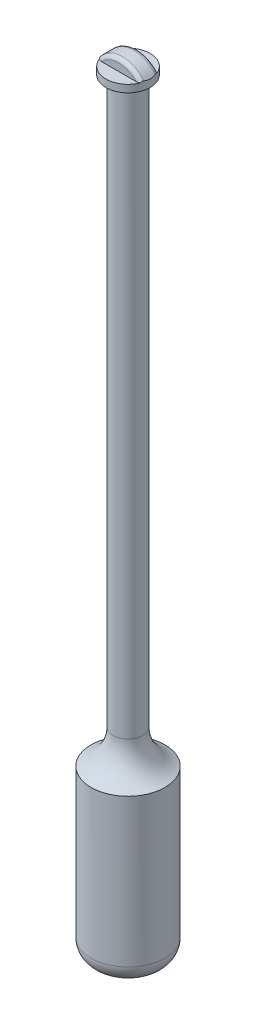
ISO-10303-21;
HEADER;
FILE_DESCRIPTION(('STEP AP214'),'2;1');
FILE_NAME('part.step','',(''),(''),'','','');
FILE_SCHEMA(('AUTOMOTIVE_DESIGN { 1 0 10303 214 1 1 1 1 }'));
ENDSEC;
DATA;
#1=APPLICATION_CONTEXT('core data for automotive mechanical design processes');
#2=APPLICATION_PROTOCOL_DEFINITION('international standard','automotive_design',2000,#1);
#3=PRODUCT_CONTEXT('',#1,'mechanical');
#4=PRODUCT('Part','Part','',(#3));
#5=PRODUCT_RELATED_PRODUCT_CATEGORY('part','',(#4));
#6=PRODUCT_DEFINITION_FORMATION('','',#4);
#7=PRODUCT_DEFINITION_CONTEXT('part definition',#1,'design');
#8=PRODUCT_DEFINITION('design','',#6,#7);
#9=PRODUCT_DEFINITION_SHAPE('','',#8);
#10=(LENGTH_UNIT() NAMED_UNIT(*) SI_UNIT(.MILLI.,.METRE.));
#11=(NAMED_UNIT(*) PLANE_ANGLE_UNIT() SI_UNIT($,.RADIAN.));
#12=(NAMED_UNIT(*) SI_UNIT($,.STERADIAN.) SOLID_ANGLE_UNIT());
#13=UNCERTAINTY_MEASURE_WITH_UNIT(LENGTH_MEASURE(1.E-05),#10,'distance_accuracy_value','');
#14=(GEOMETRIC_REPRESENTATION_CONTEXT(3) GLOBAL_UNCERTAINTY_ASSIGNED_CONTEXT((#13)) GLOBAL_UNIT_ASSIGNED_CONTEXT((#10,
#11,#12)) REPRESENTATION_CONTEXT('',''));
#15=CARTESIAN_POINT('',(0.,0.,0.));
#16=DIRECTION('',(0.,0.,1.));
#17=DIRECTION('',(1.,0.,0.));
#18=AXIS2_PLACEMENT_3D('',#15,#16,#17);
#19=CARTESIAN_POINT('',(0.,204.5,2.5));
#20=DIRECTION('',(0.,0.,-1.));
#21=DIRECTION('',(-1.,0.,0.));
#22=AXIS2_PLACEMENT_3D('',#19,#20,#21);
#23=CYLINDRICAL_SURFACE('',#22,7.5);
#24=CARTESIAN_POINT('',(5.45435605731786,209.647815070494,-2.5));
#25=CARTESIAN_POINT('',(5.50100393738986,209.598398753285,-2.39818061808659));
#26=CARTESIAN_POINT('',(5.54506690321261,209.550355885145,-2.29455820553938));
#27=CARTESIAN_POINT('',(5.62782344744621,209.457966710313,-2.08340038923625));
#28=CARTESIAN_POINT('',(5.66650935310739,209.413625721269,-1.97585966474265));
#29=CARTESIAN_POINT('',(5.77486243246658,209.286796746726,-1.64474429999279));
#30=CARTESIAN_POINT('',(5.83570460789083,209.211724438596,-1.41508251851409));
#31=CARTESIAN_POINT('',(5.90694830936014,209.121629774424,-1.0596306430481));
#32=CARTESIAN_POINT('',(5.92741576688814,209.095269025482,-0.938625335254704));
#33=CARTESIAN_POINT('',(5.96101368246352,209.051601763958,-0.693932543819982));
#34=CARTESIAN_POINT('',(5.97414420439908,209.034295172536,-0.570245083543895));
#35=CARTESIAN_POINT('',(5.99262466639059,209.009843411924,-0.32219179295885));
#36=CARTESIAN_POINT('',(5.99803021915583,209.002625620944,-0.197837347550159));
#37=CARTESIAN_POINT('',(6.0010729275826,208.998570059253,0.0511278524662602));
#38=CARTESIAN_POINT('',(5.99871124598981,209.001730734897,0.175738565920058));
#39=CARTESIAN_POINT('',(5.98720887300003,209.017012195297,0.405680064545738));
#40=CARTESIAN_POINT('',(5.97911255726774,209.027751742888,0.511159632071048));
#41=CARTESIAN_POINT('',(5.95749820879245,209.056152892795,0.720637197885987));
#42=CARTESIAN_POINT('',(5.94397811071783,209.073817131917,0.82463461614605));
#43=CARTESIAN_POINT('',(5.89547776115919,209.136395491024,1.13451879718291));
#44=CARTESIAN_POINT('',(5.8526094886552,209.190820078184,1.33732078721519));
#45=CARTESIAN_POINT('',(5.75544111239871,209.30935388473,1.70470207070848));
#46=CARTESIAN_POINT('',(5.70350614206669,209.37112078022,1.8707156802663));
#47=CARTESIAN_POINT('',(5.61647206867226,209.470630468273,2.11245512998331));
#48=CARTESIAN_POINT('',(5.58611600730553,209.504752857649,2.19143771942422));
#49=CARTESIAN_POINT('',(5.52243684510757,209.574932332353,2.34729046461068));
#50=CARTESIAN_POINT('',(5.48911461966484,209.610988845634,2.42416123489976));
#51=CARTESIAN_POINT('',(5.45435605731786,209.647815070494,2.5));
#52=B_SPLINE_CURVE_WITH_KNOTS('',3,(#24,#25,#26,#27,#28,#29,#30,#31,#32,#33,#34,#35,#36,#37,#38,
#39,#40,#41,#42,#43,#44,#45,#46,#47,#48,#49,#50,#51),.UNSPECIFIED.,.F.,.F.,(4,2,2,2,2,2,2,2,2,2,
2,2,2,4),(0.,0.367089076891562,0.734696705687965,1.47861797731172,1.85473004122881,
2.23083883000677,2.60422609911032,2.97755747513118,3.29616763528608,3.61489923490138,
4.25527034936414,4.80806602138667,5.08169306811884,5.35523962678519),.UNSPECIFIED.);
#53=CARTESIAN_POINT('',(5.80947501931113,209.243416490253,-1.49999999999999));
#54=VERTEX_POINT('',#53);
#55=CARTESIAN_POINT('',(5.80947501931115,209.243416490253,1.49999999999999));
#56=VERTEX_POINT('',#55);
#57=EDGE_CURVE('E110',#54,#56,#52,.T.);
#58=ORIENTED_EDGE('',*,*,#57,.F.);
#59=CARTESIAN_POINT('',(0.,204.5,-1.5));
#60=DIRECTION('',(0.,0.,-1.));
#61=DIRECTION('',(-1.,0.,0.));
#62=AXIS2_PLACEMENT_3D('',#59,#60,#61);
#63=CIRCLE('',#62,7.5);
#64=CARTESIAN_POINT('',(-5.80947501931115,209.243416490253,-1.49999999999999));
#65=VERTEX_POINT('',#64);
#66=EDGE_CURVE('E109',#54,#65,#63,.F.);
#67=ORIENTED_EDGE('',*,*,#66,.T.);
#68=CARTESIAN_POINT('',(-5.45435605731786,209.647815070494,2.5));
#69=CARTESIAN_POINT('',(-5.50100393738986,209.598398753285,2.39818061808659));
#70=CARTESIAN_POINT('',(-5.54506690321261,209.550355885145,2.29455820553938));
#71=CARTESIAN_POINT('',(-5.62782344744621,209.457966710313,2.08340038923625));
#72=CARTESIAN_POINT('',(-5.66650935310739,209.413625721269,1.97585966474265));
#73=CARTESIAN_POINT('',(-5.77486243246658,209.286796746726,1.64474429999279));
#74=CARTESIAN_POINT('',(-5.83570460789083,209.211724438596,1.41508251851409));
#75=CARTESIAN_POINT('',(-5.90694830936014,209.121629774424,1.0596306430481));
#76=CARTESIAN_POINT('',(-5.92741576688814,209.095269025482,0.938625335254704));
#77=CARTESIAN_POINT('',(-5.96101368246352,209.051601763958,0.693932543819982));
#78=CARTESIAN_POINT('',(-5.97414420439908,209.034295172536,0.570245083543895));
#79=CARTESIAN_POINT('',(-5.99262466639059,209.009843411924,0.32219179295885));
#80=CARTESIAN_POINT('',(-5.99803021915583,209.002625620944,0.197837347550159));
#81=CARTESIAN_POINT('',(-6.0010729275826,208.998570059253,-0.0511278524662602));
#82=CARTESIAN_POINT('',(-5.99871124598981,209.001730734897,-0.175738565920058));
#83=CARTESIAN_POINT('',(-5.98720887300003,209.017012195297,-0.405680064545738));
#84=CARTESIAN_POINT('',(-5.97911255726774,209.027751742888,-0.511159632071048));
#85=CARTESIAN_POINT('',(-5.95749820879245,209.056152892795,-0.720637197885987));
#86=CARTESIAN_POINT('',(-5.94397811071783,209.073817131917,-0.82463461614605));
#87=CARTESIAN_POINT('',(-5.89547776115919,209.136395491024,-1.13451879718291));
#88=CARTESIAN_POINT('',(-5.8526094886552,209.190820078184,-1.33732078721519));
#89=CARTESIAN_POINT('',(-5.75544111239871,209.30935388473,-1.70470207070848));
#90=CARTESIAN_POINT('',(-5.70350614206669,209.37112078022,-1.8707156802663));
#91=CARTESIAN_POINT('',(-5.61647206867226,209.470630468273,-2.11245512998331));
#92=CARTESIAN_POINT('',(-5.58611600730553,209.504752857649,-2.19143771942422));
#93=CARTESIAN_POINT('',(-5.52243684510757,209.574932332353,-2.34729046461068));
#94=CARTESIAN_POINT('',(-5.48911461966484,209.610988845634,-2.42416123489976));
#95=CARTESIAN_POINT('',(-5.45435605731786,209.647815070494,-2.5));
#96=B_SPLINE_CURVE_WITH_KNOTS('',3,(#68,#69,#70,#71,#72,#73,#74,#75,#76,#77,#78,#79,#80,#81,#82,
#83,#84,#85,#86,#87,#88,#89,#90,#91,#92,#93,#94,#95),.UNSPECIFIED.,.F.,.F.,(4,2,2,2,2,2,2,2,2,2,
2,2,2,4),(0.,0.367089076891562,0.734696705687965,1.47861797731172,1.85473004122881,
2.23083883000677,2.60422609911032,2.97755747513118,3.29616763528608,3.61489923490138,
4.25527034936414,4.80806602138667,5.08169306811884,5.35523962678519),.UNSPECIFIED.);
#97=CARTESIAN_POINT('',(-5.80947501931113,209.243416490253,1.49999999999999));
#98=VERTEX_POINT('',#97);
#99=EDGE_CURVE('E96',#98,#65,#96,.T.);
#100=ORIENTED_EDGE('',*,*,#99,.F.);
#101=CARTESIAN_POINT('',(0.,204.5,1.5));
#102=DIRECTION('',(0.,0.,-1.));
#103=DIRECTION('',(-1.,0.,0.));
#104=AXIS2_PLACEMENT_3D('',#101,#102,#103);
#105=CIRCLE('',#104,7.5);
#106=EDGE_CURVE('E106',#98,#56,#105,.T.);
#107=ORIENTED_EDGE('',*,*,#106,.T.);
#108=EDGE_LOOP('',(#58,#67,#100,#107));
#109=FACE_BOUND('',#108,.T.);
#110=ADVANCED_FACE('F34',(#109),#23,.T.);
#111=CARTESIAN_POINT('',(0.,204.5,2.5));
#112=DIRECTION('',(0.,0.,-1.));
#113=DIRECTION('',(-1.,0.,0.));
#114=AXIS2_PLACEMENT_3D('',#111,#112,#113);
#115=PLANE('',#114);
#116=DIRECTION('',(-1.,0.,0.));
#117=VECTOR('',#116,1.);
#118=CARTESIAN_POINT('',(0.,209.,2.5));
#119=LINE('',#118,#117);
#120=CARTESIAN_POINT('',(4.69041575982343,209.,2.5));
#121=VERTEX_POINT('',#120);
#122=CARTESIAN_POINT('',(-4.69041575982343,209.,2.5));
#123=VERTEX_POINT('',#122);
#124=EDGE_CURVE('E117',#121,#123,#119,.T.);
#125=ORIENTED_EDGE('',*,*,#124,.F.);
#126=CARTESIAN_POINT('',(0.,204.5,2.5));
#127=DIRECTION('',(0.,0.,-1.));
#128=DIRECTION('',(-1.,0.,0.));
#129=AXIS2_PLACEMENT_3D('',#126,#127,#128);
#130=CIRCLE('',#129,6.5);
#131=EDGE_CURVE('E167',#121,#123,#130,.F.);
#132=ORIENTED_EDGE('',*,*,#131,.T.);
#133=EDGE_LOOP('',(#125,#132));
#134=FACE_BOUND('',#133,.T.);
#135=ADVANCED_FACE('F206',(#134),#115,.F.);
#136=CARTESIAN_POINT('',(0.,204.5,-2.5));
#137=DIRECTION('',(0.,0.,-1.));
#138=DIRECTION('',(-1.,0.,0.));
#139=AXIS2_PLACEMENT_3D('',#136,#137,#138);
#140=PLANE('',#139);
#141=DIRECTION('',(-1.,0.,0.));
#142=VECTOR('',#141,1.);
#143=CARTESIAN_POINT('',(0.,209.,-2.5));
#144=LINE('',#143,#142);
#145=CARTESIAN_POINT('',(4.69041575982343,209.,-2.5));
#146=VERTEX_POINT('',#145);
#147=CARTESIAN_POINT('',(-4.69041575982343,209.,-2.5));
#148=VERTEX_POINT('',#147);
#149=EDGE_CURVE('E190',#146,#148,#144,.T.);
#150=ORIENTED_EDGE('',*,*,#149,.T.);
#151=CARTESIAN_POINT('',(0.,204.5,-2.5));
#152=DIRECTION('',(0.,0.,-1.));
#153=DIRECTION('',(-1.,0.,0.));
#154=AXIS2_PLACEMENT_3D('',#151,#152,#153);
#155=CIRCLE('',#154,6.5);
#156=EDGE_CURVE('E323',#148,#146,#155,.T.);
#157=ORIENTED_EDGE('',*,*,#156,.T.);
#158=EDGE_LOOP('',(#150,#157));
#159=FACE_BOUND('',#158,.T.);
#160=ADVANCED_FACE('F209',(#159),#140,.T.);
#161=CARTESIAN_POINT('',(0.,209.,0.));
#162=DIRECTION('',(0.,1.,0.));
#163=DIRECTION('',(0.,0.,1.));
#164=AXIS2_PLACEMENT_3D('',#161,#162,#163);
#165=PLANE('',#164);
#166=CARTESIAN_POINT('',(0.,209.,0.));
#167=DIRECTION('',(0.,1.,0.));
#168=DIRECTION('',(0.,0.,1.));
#169=AXIS2_PLACEMENT_3D('',#166,#167,#168);
#170=CIRCLE('',#169,6.);
#171=CARTESIAN_POINT('',(-5.55879503975131,209.,2.25827316904671));
#172=VERTEX_POINT('',#171);
#173=CARTESIAN_POINT('',(5.55879503975131,209.,2.25827316904671));
#174=VERTEX_POINT('',#173);
#175=EDGE_CURVE('E98',#172,#174,#170,.T.);
#176=ORIENTED_EDGE('',*,*,#175,.T.);
#177=CARTESIAN_POINT('',(5.55879503975131,209.,2.25827316904671));
#178=CARTESIAN_POINT('',(5.48678233533883,209.,2.3063245503226));
#179=CARTESIAN_POINT('',(5.41009743104707,209.,2.34654228222022));
#180=CARTESIAN_POINT('',(5.2524774518483,209.,2.41172382246996));
#181=CARTESIAN_POINT('',(5.17167924843951,209.,2.43701469314759));
#182=CARTESIAN_POINT('',(5.02472243432359,209.,2.47083664106111));
#183=CARTESIAN_POINT('',(4.9590817877117,209.,2.48178108232805));
#184=CARTESIAN_POINT('',(4.8257639956104,209.,2.49642054674034));
#185=CARTESIAN_POINT('',(4.75807158470039,209.,2.4999788239361));
#186=CARTESIAN_POINT('',(4.69041575982343,209.,2.5));
#187=B_SPLINE_CURVE_WITH_KNOTS('',3,(#177,#178,#179,#180,#181,#182,#183,#184,#185,#186),
.UNSPECIFIED.,.F.,.F.,(4,2,2,2,4),(0.,0.25859706995204,0.511294664713231,0.710547332312552,
0.913457168867879),.UNSPECIFIED.);
#188=EDGE_CURVE('E12',#174,#121,#187,.T.);
#189=ORIENTED_EDGE('',*,*,#188,.T.);
#190=ORIENTED_EDGE('',*,*,#124,.T.);
#191=CARTESIAN_POINT('',(-4.69041575982343,209.,2.5));
#192=CARTESIAN_POINT('',(-4.77574325814398,209.,2.49997391904809));
#193=CARTESIAN_POINT('',(-4.86130209307591,209.,2.49430200358767));
#194=CARTESIAN_POINT('',(-5.02865223131832,209.,2.47079207200527));
#195=CARTESIAN_POINT('',(-5.11048485294655,209.,2.45324149410005));
#196=CARTESIAN_POINT('',(-5.25485146725927,209.,2.40985447802828));
#197=CARTESIAN_POINT('',(-5.31805131520623,209.,2.38628387835557));
#198=CARTESIAN_POINT('',(-5.44149509589768,209.,2.32965856214063));
#199=CARTESIAN_POINT('',(-5.50165862849681,209.,2.29642988457705));
#200=CARTESIAN_POINT('',(-5.55879503975131,209.,2.25827316904671));
#201=B_SPLINE_CURVE_WITH_KNOTS('',3,(#191,#192,#193,#194,#195,#196,#197,#198,#199,#200),
.UNSPECIFIED.,.F.,.F.,(4,2,2,2,4),(0.,0.256155563674324,0.506324386732511,0.707996127014091,
0.913553014759006),.UNSPECIFIED.);
#202=EDGE_CURVE('E47',#123,#172,#201,.T.);
#203=ORIENTED_EDGE('',*,*,#202,.T.);
#204=EDGE_LOOP('',(#176,#189,#190,#203));
#205=FACE_BOUND('',#204,.T.);
#206=ADVANCED_FACE('F175',(#205),#165,.T.);
#207=CARTESIAN_POINT('',(0.,45.,0.));
#208=DIRECTION('',(0.,-1.,0.));
#209=DIRECTION('',(0.,0.,-1.));
#210=AXIS2_PLACEMENT_3D('',#207,#208,#209);
#211=CYLINDRICAL_SURFACE('',#210,10.);
#212=CARTESIAN_POINT('',(0.,4.99999999999998,0.));
#213=DIRECTION('',(0.,1.,0.));
#214=DIRECTION('',(0.,0.,1.));
#215=AXIS2_PLACEMENT_3D('',#212,#213,#214);
#216=CIRCLE('',#215,10.);
#217=CARTESIAN_POINT('',(0.,4.99999999999998,-10.));
#218=VERTEX_POINT('',#217);
#219=EDGE_CURVE('E315',#218,#218,#216,.T.);
#220=CARTESIAN_POINT('',(0.,45.,0.));
#221=DIRECTION('',(0.,1.,0.));
#222=DIRECTION('',(0.,0.,1.));
#223=AXIS2_PLACEMENT_3D('',#220,#221,#222);
#224=CIRCLE('',#223,10.);
#225=CARTESIAN_POINT('',(0.,45.,-10.));
#226=VERTEX_POINT('',#225);
#227=EDGE_CURVE('E308',#226,#226,#224,.T.);
#228=CARTESIAN_POINT('',(0.,4.99999999999998,-10.));
#229=CARTESIAN_POINT('',(0.,5.41666666666665,-10.));
#230=CARTESIAN_POINT('',(0.,5.83333333333332,-10.));
#231=CARTESIAN_POINT('',(0.,6.66666666666665,-10.));
#232=CARTESIAN_POINT('',(0.,7.08333333333332,-10.));
#233=CARTESIAN_POINT('',(0.,7.91666666666665,-10.));
#234=CARTESIAN_POINT('',(0.,8.33333333333332,-10.));
#235=CARTESIAN_POINT('',(0.,9.16666666666666,-10.));
#236=CARTESIAN_POINT('',(0.,9.58333333333332,-10.));
#237=CARTESIAN_POINT('',(0.,10.4166666666667,-10.));
#238=CARTESIAN_POINT('',(0.,10.8333333333333,-10.));
#239=CARTESIAN_POINT('',(0.,11.6666666666667,-10.));
#240=CARTESIAN_POINT('',(0.,12.0833333333333,-10.));
#241=CARTESIAN_POINT('',(0.,12.9166666666667,-10.));
#242=CARTESIAN_POINT('',(0.,13.3333333333333,-10.));
#243=CARTESIAN_POINT('',(0.,14.1666666666667,-10.));
#244=CARTESIAN_POINT('',(0.,14.5833333333333,-10.));
#245=CARTESIAN_POINT('',(0.,15.4166666666667,-10.));
#246=CARTESIAN_POINT('',(0.,15.8333333333333,-10.));
#247=CARTESIAN_POINT('',(0.,16.6666666666667,-10.));
#248=CARTESIAN_POINT('',(0.,17.0833333333333,-10.));
#249=CARTESIAN_POINT('',(0.,17.9166666666667,-10.));
#250=CARTESIAN_POINT('',(0.,18.3333333333333,-10.));
#251=CARTESIAN_POINT('',(0.,19.1666666666667,-10.));
#252=CARTESIAN_POINT('',(0.,19.5833333333333,-10.));
#253=CARTESIAN_POINT('',(0.,20.4166666666667,-10.));
#254=CARTESIAN_POINT('',(0.,20.8333333333333,-10.));
#255=CARTESIAN_POINT('',(0.,21.6666666666667,-10.));
#256=CARTESIAN_POINT('',(0.,22.0833333333333,-10.));
#257=CARTESIAN_POINT('',(0.,22.9166666666667,-10.));
#258=CARTESIAN_POINT('',(0.,23.3333333333333,-10.));
#259=CARTESIAN_POINT('',(0.,24.1666666666667,-10.));
#260=CARTESIAN_POINT('',(0.,24.5833333333333,-10.));
#261=CARTESIAN_POINT('',(0.,25.4166666666667,-10.));
#262=CARTESIAN_POINT('',(0.,25.8333333333333,-10.));
#263=CARTESIAN_POINT('',(0.,26.6666666666667,-10.));
#264=CARTESIAN_POINT('',(0.,27.0833333333333,-10.));
#265=CARTESIAN_POINT('',(0.,27.9166666666667,-10.));
#266=CARTESIAN_POINT('',(0.,28.3333333333333,-10.));
#267=CARTESIAN_POINT('',(0.,29.1666666666667,-10.));
#268=CARTESIAN_POINT('',(0.,29.5833333333333,-10.));
#269=CARTESIAN_POINT('',(0.,30.4166666666667,-10.));
#270=CARTESIAN_POINT('',(0.,30.8333333333333,-10.));
#271=CARTESIAN_POINT('',(0.,31.6666666666667,-10.));
#272=CARTESIAN_POINT('',(0.,32.0833333333333,-10.));
#273=CARTESIAN_POINT('',(0.,32.9166666666667,-10.));
#274=CARTESIAN_POINT('',(0.,33.3333333333333,-10.));
#275=CARTESIAN_POINT('',(0.,34.1666666666667,-10.));
#276=CARTESIAN_POINT('',(0.,34.5833333333333,-10.));
#277=CARTESIAN_POINT('',(0.,35.4166666666667,-10.));
#278=CARTESIAN_POINT('',(0.,35.8333333333333,-10.));
#279=CARTESIAN_POINT('',(0.,36.6666666666667,-10.));
#280=CARTESIAN_POINT('',(0.,37.0833333333333,-10.));
#281=CARTESIAN_POINT('',(0.,37.9166666666667,-10.));
#282=CARTESIAN_POINT('',(0.,38.3333333333333,-10.));
#283=CARTESIAN_POINT('',(0.,39.1666666666667,-10.));
#284=CARTESIAN_POINT('',(0.,39.5833333333333,-10.));
#285=CARTESIAN_POINT('',(0.,40.4166666666667,-10.));
#286=CARTESIAN_POINT('',(0.,40.8333333333333,-10.));
#287=CARTESIAN_POINT('',(0.,41.6666666666667,-10.));
#288=CARTESIAN_POINT('',(0.,42.0833333333333,-10.));
#289=CARTESIAN_POINT('',(0.,42.9166666666667,-10.));
#290=CARTESIAN_POINT('',(0.,43.3333333333333,-10.));
#291=CARTESIAN_POINT('',(0.,44.1666666666667,-10.));
#292=CARTESIAN_POINT('',(0.,44.5833333333333,-10.));
#293=CARTESIAN_POINT('',(0.,45.,-10.));
#294=B_SPLINE_CURVE_WITH_KNOTS('',3,(#228,#229,#230,#231,#232,#233,#234,#235,#236,#237,#238,
#239,#240,#241,#242,#243,#244,#245,#246,#247,#248,#249,#250,#251,#252,#253,#254,#255,#256,#257,
#258,#259,#260,#261,#262,#263,#264,#265,#266,#267,#268,#269,#270,#271,#272,#273,#274,#275,#276,
#277,#278,#279,#280,#281,#282,#283,#284,#285,#286,#287,#288,#289,#290,#291,#292,#293),
.UNSPECIFIED.,.F.,.F.,(4,2,2,2,2,2,2,2,2,2,2,2,2,2,2,2,2,2,2,2,2,2,2,2,2,2,2,2,2,2,2,2,4),(0.,
1.25,2.5,3.75,5.,6.25000000000001,7.50000000000001,8.75,10.,11.25,12.5,13.75,15.,16.25,17.5,
18.75,20.,21.25,22.5,23.75,25.,26.25,27.5,28.75,30.,31.25,32.5,33.75,35.,36.25,37.5,38.75,40.),.UNSPECIFIED.);
#295=EDGE_CURVE('BSEAM216',#218,#226,#294,.T.);
#296=ORIENTED_EDGE('',*,*,#219,.T.);
#297=ORIENTED_EDGE('',*,*,#227,.F.);
#298=ORIENTED_EDGE('',*,*,#295,.T.);
#299=ORIENTED_EDGE('',*,*,#295,.F.);
#300=EDGE_LOOP('',(#296,#298,#297,#299));
#301=FACE_BOUND('',#300,.T.);
#302=ADVANCED_FACE('F216',(#301),#211,.T.);
#303=CARTESIAN_POINT('',(0.,0.,0.));
#304=DIRECTION('',(0.,1.,0.));
#305=DIRECTION('',(0.,0.,1.));
#306=AXIS2_PLACEMENT_3D('',#303,#304,#305);
#307=PLANE('',#306);
#308=CARTESIAN_POINT('',(0.,0.,0.));
#309=DIRECTION('',(0.,1.,0.));
#310=DIRECTION('',(0.,0.,1.));
#311=AXIS2_PLACEMENT_3D('',#308,#309,#310);
#312=CIRCLE('',#311,5.);
#313=CARTESIAN_POINT('',(0.,0.,5.));
#314=VERTEX_POINT('',#313);
#315=EDGE_CURVE('E320',#314,#314,#312,.F.);
#316=ORIENTED_EDGE('',*,*,#315,.T.);
#317=EDGE_LOOP('',(#316));
#318=FACE_BOUND('',#317,.T.);
#319=ADVANCED_FACE('F248',(#318),#307,.F.);
#320=CARTESIAN_POINT('',(0.,5.,0.));
#321=DIRECTION('',(0.,1.,0.));
#322=DIRECTION('',(0.,0.,1.));
#323=AXIS2_PLACEMENT_3D('',#320,#321,#322);
#324=DEGENERATE_TOROIDAL_SURFACE('',#323,5.,5.,.T.);
#325=ORIENTED_EDGE('',*,*,#315,.F.);
#326=EDGE_LOOP('',(#325));
#327=FACE_BOUND('',#326,.T.);
#328=ORIENTED_EDGE('',*,*,#219,.F.);
#329=EDGE_LOOP('',(#328));
#330=FACE_BOUND('',#329,.T.);
#331=ADVANCED_FACE('F256',(#327,#330),#324,.T.);
#332=CARTESIAN_POINT('',(0.,207.,0.));
#333=DIRECTION('',(0.,-1.,0.));
#334=DIRECTION('',(0.,0.,-1.));
#335=AXIS2_PLACEMENT_3D('',#332,#333,#334);
#336=CYLINDRICAL_SURFACE('',#335,4.);
#337=CARTESIAN_POINT('',(0.,54.1651513899117,0.));
#338=DIRECTION('',(0.,-1.,0.));
#339=DIRECTION('',(0.,0.,-1.));
#340=AXIS2_PLACEMENT_3D('',#337,#338,#339);
#341=CIRCLE('',#340,4.);
#342=CARTESIAN_POINT('',(0.,54.1651513899117,-4.));
#343=VERTEX_POINT('',#342);
#344=EDGE_CURVE('E113',#343,#343,#341,.F.);
#345=ORIENTED_EDGE('',*,*,#344,.T.);
#346=EDGE_LOOP('',(#345));
#347=FACE_BOUND('',#346,.T.);
#348=CARTESIAN_POINT('',(0.,207.,0.));
#349=DIRECTION('',(0.,1.,0.));
#350=DIRECTION('',(0.,0.,1.));
#351=AXIS2_PLACEMENT_3D('',#348,#349,#350);
#352=CIRCLE('',#351,4.);
#353=CARTESIAN_POINT('',(0.,207.,4.));
#354=VERTEX_POINT('',#353);
#355=EDGE_CURVE('E313',#354,#354,#352,.T.);
#356=ORIENTED_EDGE('',*,*,#355,.F.);
#357=EDGE_LOOP('',(#356));
#358=FACE_BOUND('',#357,.T.);
#359=ADVANCED_FACE('F134',(#347,#358),#336,.T.);
#360=CARTESIAN_POINT('',(0.,209.,0.));
#361=DIRECTION('',(0.,-1.,0.));
#362=DIRECTION('',(0.,0.,-1.));
#363=AXIS2_PLACEMENT_3D('',#360,#361,#362);
#364=CYLINDRICAL_SURFACE('',#363,6.);
#365=CARTESIAN_POINT('',(-5.80947501931095,209.243416490253,-1.5));
#366=CARTESIAN_POINT('',(-5.7995966427797,209.255578064948,-1.5383163072128));
#367=CARTESIAN_POINT('',(-5.78906890235574,209.264849119946,-1.57746919367637));
#368=CARTESIAN_POINT('',(-5.76691269783154,209.277011327438,-1.65661319653982));
#369=CARTESIAN_POINT('',(-5.75527989658466,209.27987615916,-1.69660709210914));
#370=CARTESIAN_POINT('',(-5.73114840901714,209.278514213841,-1.7764268669925));
#371=CARTESIAN_POINT('',(-5.71864644460856,209.274259018337,-1.81625143391455));
#372=CARTESIAN_POINT('',(-5.69330420497367,209.258386630254,-1.89419091207176));
#373=CARTESIAN_POINT('',(-5.68046488696955,209.246788481253,-1.93230997346933));
#374=CARTESIAN_POINT('',(-5.65567784397613,209.217361710687,-2.00366157042181));
#375=CARTESIAN_POINT('',(-5.64371996948182,209.199911556807,-2.03704761972924));
#376=CARTESIAN_POINT('',(-5.62042256694974,209.159323086111,-2.10047494119993));
#377=CARTESIAN_POINT('',(-5.60908398877047,209.136176315656,-2.1305111451256));
#378=CARTESIAN_POINT('',(-5.59118741591511,209.094015890791,-2.17692732980979));
#379=CARTESIAN_POINT('',(-5.58433228586712,209.076341422819,-2.19443762545884));
#380=CARTESIAN_POINT('',(-5.57115709543464,209.039345760029,-2.22767235645018));
#381=CARTESIAN_POINT('',(-5.56483489385643,209.020031849023,-2.24340403441273));
#382=CARTESIAN_POINT('',(-5.55879503975131,209.,-2.25827316904672));
#383=B_SPLINE_CURVE_WITH_KNOTS('',3,(#365,#366,#367,#368,#369,#370,#371,#372,#373,#374,#375,
#376,#377,#378,#379,#380,#381,#382),.UNSPECIFIED.,.F.,.F.,(4,2,2,2,2,2,2,2,4),(0.,
0.124200813795165,0.248910991842347,0.374120119119565,0.499005845635578,0.617011091294225,
0.73519252105179,0.812501023092578,0.889482427978524),.UNSPECIFIED.);
#384=CARTESIAN_POINT('',(-5.55879503975131,209.,-2.25827316904671));
#385=VERTEX_POINT('',#384);
#386=EDGE_CURVE('E144',#65,#385,#383,.T.);
#387=ORIENTED_EDGE('',*,*,#386,.T.);
#388=CARTESIAN_POINT('',(5.55879503975131,209.,-2.25827316904671));
#389=VERTEX_POINT('',#388);
#390=EDGE_CURVE('E188',#389,#385,#170,.T.);
#391=ORIENTED_EDGE('',*,*,#390,.F.);
#392=CARTESIAN_POINT('',(5.55879503975131,209.,-2.25827316904671));
#393=CARTESIAN_POINT('',(5.56840310750305,209.031958966517,-2.23462140023928));
#394=CARTESIAN_POINT('',(5.57877592402322,209.062091375409,-2.20865709401905));
#395=CARTESIAN_POINT('',(5.60072101400401,209.117658191083,-2.1524033539988));
#396=CARTESIAN_POINT('',(5.61229664938509,209.14307884538,-2.12210170292737));
#397=CARTESIAN_POINT('',(5.63631109600536,209.188080143926,-2.05747049521604));
#398=CARTESIAN_POINT('',(5.64875350866851,209.207634380367,-2.02312366626348));
#399=CARTESIAN_POINT('',(5.67388666674162,209.239873222608,-1.95152342217044));
#400=CARTESIAN_POINT('',(5.68657680722077,209.252572810631,-1.91427655138642));
#401=CARTESIAN_POINT('',(5.71100657644892,209.270323050963,-1.84006727536912));
#402=CARTESIAN_POINT('',(5.72276050205289,209.275750106503,-1.8031983549009));
#403=CARTESIAN_POINT('',(5.74566370699262,209.280324430859,-1.72883309496141));
#404=CARTESIAN_POINT('',(5.75681203620402,209.279462103463,-1.69133588385378));
#405=CARTESIAN_POINT('',(5.77498736716691,209.273007076376,-1.62796172244442));
#406=CARTESIAN_POINT('',(5.78224528765173,209.268915435873,-1.60198245957854));
#407=CARTESIAN_POINT('',(5.7962462975896,209.258087759333,-1.55056136805486));
#408=CARTESIAN_POINT('',(5.80299145872146,209.2513631231,-1.52511771427316));
#409=CARTESIAN_POINT('',(5.80947501931113,209.243416490253,-1.5));
#410=B_SPLINE_CURVE_WITH_KNOTS('',3,(#392,#393,#394,#395,#396,#397,#398,#399,#400,#401,#402,
#403,#404,#405,#406,#407,#408,#409),.UNSPECIFIED.,.F.,.F.,(4,2,2,2,2,2,2,2,4),(0.,
0.122740142167957,0.245833078205716,0.369472080781753,0.492839739588096,0.609537826204857,
0.726414005596959,0.808130729354611,0.889497496952162),.UNSPECIFIED.);
#411=EDGE_CURVE('E100',#389,#54,#410,.T.);
#412=ORIENTED_EDGE('',*,*,#411,.T.);
#413=ORIENTED_EDGE('',*,*,#57,.T.);
#414=CARTESIAN_POINT('',(5.80947501931095,209.243416490253,1.5));
#415=CARTESIAN_POINT('',(5.7995966427797,209.255578064948,1.5383163072128));
#416=CARTESIAN_POINT('',(5.78906890235574,209.264849119946,1.57746919367637));
#417=CARTESIAN_POINT('',(5.76691269783154,209.277011327438,1.65661319653982));
#418=CARTESIAN_POINT('',(5.75527989658466,209.27987615916,1.69660709210914));
#419=CARTESIAN_POINT('',(5.73114840901714,209.278514213841,1.7764268669925));
#420=CARTESIAN_POINT('',(5.71864644460856,209.274259018337,1.81625143391455));
#421=CARTESIAN_POINT('',(5.69330420497367,209.258386630254,1.89419091207176));
#422=CARTESIAN_POINT('',(5.68046488696955,209.246788481253,1.93230997346933));
#423=CARTESIAN_POINT('',(5.65567784397613,209.217361710687,2.00366157042181));
#424=CARTESIAN_POINT('',(5.64371996948182,209.199911556807,2.03704761972924));
#425=CARTESIAN_POINT('',(5.62042256694974,209.159323086111,2.10047494119993));
#426=CARTESIAN_POINT('',(5.60908398877047,209.136176315656,2.1305111451256));
#427=CARTESIAN_POINT('',(5.59118741591511,209.094015890791,2.17692732980979));
#428=CARTESIAN_POINT('',(5.58433228586712,209.076341422819,2.19443762545884));
#429=CARTESIAN_POINT('',(5.57115709543464,209.039345760029,2.22767235645018));
#430=CARTESIAN_POINT('',(5.56483489385643,209.020031849023,2.24340403441273));
#431=CARTESIAN_POINT('',(5.55879503975131,209.,2.25827316904672));
#432=B_SPLINE_CURVE_WITH_KNOTS('',3,(#414,#415,#416,#417,#418,#419,#420,#421,#422,#423,#424,
#425,#426,#427,#428,#429,#430,#431),.UNSPECIFIED.,.F.,.F.,(4,2,2,2,2,2,2,2,4),(0.,
0.124200813795165,0.248910991842347,0.374120119119565,0.499005845635578,0.617011091294225,
0.73519252105179,0.812501023092578,0.889482427978524),.UNSPECIFIED.);
#433=EDGE_CURVE('E101',#56,#174,#432,.T.);
#434=ORIENTED_EDGE('',*,*,#433,.T.);
#435=ORIENTED_EDGE('',*,*,#175,.F.);
#436=CARTESIAN_POINT('',(-5.55879503975131,209.,2.25827316904671));
#437=CARTESIAN_POINT('',(-5.56840310750305,209.031958966517,2.23462140023928));
#438=CARTESIAN_POINT('',(-5.57877592402322,209.062091375409,2.20865709401905));
#439=CARTESIAN_POINT('',(-5.60072101400401,209.117658191083,2.1524033539988));
#440=CARTESIAN_POINT('',(-5.61229664938509,209.14307884538,2.12210170292737));
#441=CARTESIAN_POINT('',(-5.63631109600536,209.188080143926,2.05747049521604));
#442=CARTESIAN_POINT('',(-5.64875350866851,209.207634380367,2.02312366626348));
#443=CARTESIAN_POINT('',(-5.67388666674162,209.239873222608,1.95152342217044));
#444=CARTESIAN_POINT('',(-5.68657680722077,209.252572810631,1.91427655138642));
#445=CARTESIAN_POINT('',(-5.71100657644892,209.270323050963,1.84006727536912));
#446=CARTESIAN_POINT('',(-5.72276050205289,209.275750106503,1.8031983549009));
#447=CARTESIAN_POINT('',(-5.74566370699262,209.280324430859,1.72883309496141));
#448=CARTESIAN_POINT('',(-5.75681203620402,209.279462103463,1.69133588385378));
#449=CARTESIAN_POINT('',(-5.77498736716691,209.273007076376,1.62796172244442));
#450=CARTESIAN_POINT('',(-5.78224528765173,209.268915435873,1.60198245957854));
#451=CARTESIAN_POINT('',(-5.7962462975896,209.258087759333,1.55056136805486));
#452=CARTESIAN_POINT('',(-5.80299145872146,209.2513631231,1.52511771427316));
#453=CARTESIAN_POINT('',(-5.80947501931113,209.243416490253,1.5));
#454=B_SPLINE_CURVE_WITH_KNOTS('',3,(#436,#437,#438,#439,#440,#441,#442,#443,#444,#445,#446,
#447,#448,#449,#450,#451,#452,#453),.UNSPECIFIED.,.F.,.F.,(4,2,2,2,2,2,2,2,4),(0.,
0.122740142167957,0.245833078205716,0.369472080781753,0.492839739588096,0.609537826204857,
0.726414005596959,0.808130729354611,0.889497496952162),.UNSPECIFIED.);
#455=EDGE_CURVE('E91',#172,#98,#454,.T.);
#456=ORIENTED_EDGE('',*,*,#455,.T.);
#457=ORIENTED_EDGE('',*,*,#99,.T.);
#458=EDGE_LOOP('',(#387,#391,#412,#413,#434,#435,#456,#457));
#459=FACE_BOUND('',#458,.T.);
#460=CARTESIAN_POINT('',(0.,207.,0.));
#461=DIRECTION('',(0.,1.,0.));
#462=DIRECTION('',(0.,0.,1.));
#463=AXIS2_PLACEMENT_3D('',#460,#461,#462);
#464=CIRCLE('',#463,6.);
#465=CARTESIAN_POINT('',(0.,207.,6.));
#466=VERTEX_POINT('',#465);
#467=EDGE_CURVE('E192',#466,#466,#464,.T.);
#468=ORIENTED_EDGE('',*,*,#467,.T.);
#469=EDGE_LOOP('',(#468));
#470=FACE_BOUND('',#469,.T.);
#471=ADVANCED_FACE('F94',(#459,#470),#364,.T.);
#472=ORIENTED_EDGE('',*,*,#149,.F.);
#473=CARTESIAN_POINT('',(4.69041575982343,209.,-2.5));
#474=CARTESIAN_POINT('',(4.77574325814398,209.,-2.49997391904809));
#475=CARTESIAN_POINT('',(4.86130209307591,209.,-2.49430200358767));
#476=CARTESIAN_POINT('',(5.02865223131832,209.,-2.47079207200527));
#477=CARTESIAN_POINT('',(5.11048485294655,209.,-2.45324149410005));
#478=CARTESIAN_POINT('',(5.25485146725927,209.,-2.40985447802828));
#479=CARTESIAN_POINT('',(5.31805131520623,209.,-2.38628387835557));
#480=CARTESIAN_POINT('',(5.44149509589768,209.,-2.32965856214063));
#481=CARTESIAN_POINT('',(5.50165862849681,209.,-2.29642988457705));
#482=CARTESIAN_POINT('',(5.55879503975131,209.,-2.25827316904671));
#483=B_SPLINE_CURVE_WITH_KNOTS('',3,(#473,#474,#475,#476,#477,#478,#479,#480,#481,#482),
.UNSPECIFIED.,.F.,.F.,(4,2,2,2,4),(0.,0.256155563674324,0.506324386732511,0.707996127014091,
0.913553014759006),.UNSPECIFIED.);
#484=EDGE_CURVE('E166',#146,#389,#483,.T.);
#485=ORIENTED_EDGE('',*,*,#484,.T.);
#486=ORIENTED_EDGE('',*,*,#390,.T.);
#487=CARTESIAN_POINT('',(-5.55879503975131,209.,-2.25827316904671));
#488=CARTESIAN_POINT('',(-5.48678233533883,209.,-2.3063245503226));
#489=CARTESIAN_POINT('',(-5.41009743104707,209.,-2.34654228222022));
#490=CARTESIAN_POINT('',(-5.2524774518483,209.,-2.41172382246996));
#491=CARTESIAN_POINT('',(-5.17167924843951,209.,-2.43701469314759));
#492=CARTESIAN_POINT('',(-5.02472243432359,209.,-2.47083664106111));
#493=CARTESIAN_POINT('',(-4.9590817877117,209.,-2.48178108232805));
#494=CARTESIAN_POINT('',(-4.8257639956104,209.,-2.49642054674034));
#495=CARTESIAN_POINT('',(-4.75807158470039,209.,-2.4999788239361));
#496=CARTESIAN_POINT('',(-4.69041575982343,209.,-2.5));
#497=B_SPLINE_CURVE_WITH_KNOTS('',3,(#487,#488,#489,#490,#491,#492,#493,#494,#495,#496),
.UNSPECIFIED.,.F.,.F.,(4,2,2,2,4),(0.,0.25859706995204,0.511294664713231,0.710547332312552,
0.913457168867879),.UNSPECIFIED.);
#498=EDGE_CURVE('E161',#385,#148,#497,.T.);
#499=ORIENTED_EDGE('',*,*,#498,.T.);
#500=EDGE_LOOP('',(#472,#485,#486,#499));
#501=FACE_BOUND('',#500,.T.);
#502=ADVANCED_FACE('F133',(#501),#165,.T.);
#503=CARTESIAN_POINT('',(0.,207.,0.));
#504=DIRECTION('',(0.,1.,0.));
#505=DIRECTION('',(0.,0.,1.));
#506=AXIS2_PLACEMENT_3D('',#503,#504,#505);
#507=PLANE('',#506);
#508=ORIENTED_EDGE('',*,*,#355,.T.);
#509=EDGE_LOOP('',(#508));
#510=FACE_BOUND('',#509,.T.);
#511=ORIENTED_EDGE('',*,*,#467,.F.);
#512=EDGE_LOOP('',(#511));
#513=FACE_BOUND('',#512,.T.);
#514=ADVANCED_FACE('F135',(#510,#513),#507,.F.);
#515=CARTESIAN_POINT('',(0.,54.1651513899117,0.));
#516=DIRECTION('',(0.,-1.,0.));
#517=DIRECTION('',(0.,0.,-1.));
#518=AXIS2_PLACEMENT_3D('',#515,#516,#517);
#519=TOROIDAL_SURFACE('',#518,14.,10.);
#520=ORIENTED_EDGE('',*,*,#227,.T.);
#521=EDGE_LOOP('',(#520));
#522=FACE_BOUND('',#521,.T.);
#523=ORIENTED_EDGE('',*,*,#344,.F.);
#524=EDGE_LOOP('',(#523));
#525=FACE_BOUND('',#524,.T.);
#526=ADVANCED_FACE('F153',(#522,#525),#519,.F.);
#527=CARTESIAN_POINT('',(0.,204.5,-1.5));
#528=DIRECTION('',(0.,0.,-1.));
#529=DIRECTION('',(-1.,0.,0.));
#530=AXIS2_PLACEMENT_3D('',#527,#528,#529);
#531=TOROIDAL_SURFACE('',#530,6.5,1.);
#532=ORIENTED_EDGE('',*,*,#484,.F.);
#533=ORIENTED_EDGE('',*,*,#156,.F.);
#534=ORIENTED_EDGE('',*,*,#498,.F.);
#535=ORIENTED_EDGE('',*,*,#386,.F.);
#536=ORIENTED_EDGE('',*,*,#66,.F.);
#537=ORIENTED_EDGE('',*,*,#411,.F.);
#538=EDGE_LOOP('',(#532,#533,#534,#535,#536,#537));
#539=FACE_BOUND('',#538,.T.);
#540=ADVANCED_FACE('F149',(#539),#531,.T.);
#541=CARTESIAN_POINT('',(0.,204.5,1.5));
#542=DIRECTION('',(0.,0.,-1.));
#543=DIRECTION('',(-1.,0.,0.));
#544=AXIS2_PLACEMENT_3D('',#541,#542,#543);
#545=TOROIDAL_SURFACE('',#544,6.5,1.);
#546=ORIENTED_EDGE('',*,*,#433,.F.);
#547=ORIENTED_EDGE('',*,*,#106,.F.);
#548=ORIENTED_EDGE('',*,*,#455,.F.);
#549=ORIENTED_EDGE('',*,*,#202,.F.);
#550=ORIENTED_EDGE('',*,*,#131,.F.);
#551=ORIENTED_EDGE('',*,*,#188,.F.);
#552=EDGE_LOOP('',(#546,#547,#548,#549,#550,#551));
#553=FACE_BOUND('',#552,.T.);
#554=ADVANCED_FACE('F36',(#553),#545,.T.);
#555=CLOSED_SHELL('',(#110,#135,#160,#206,#302,#319,#331,#359,#471,#502,#514,#526,#540,#554));
#556=MANIFOLD_SOLID_BREP('B2',#555);
#557=ADVANCED_BREP_SHAPE_REPRESENTATION('',(#18,#556),#14);
#558=SHAPE_DEFINITION_REPRESENTATION(#9,#557);
ENDSEC;
END-ISO-10303-21;
